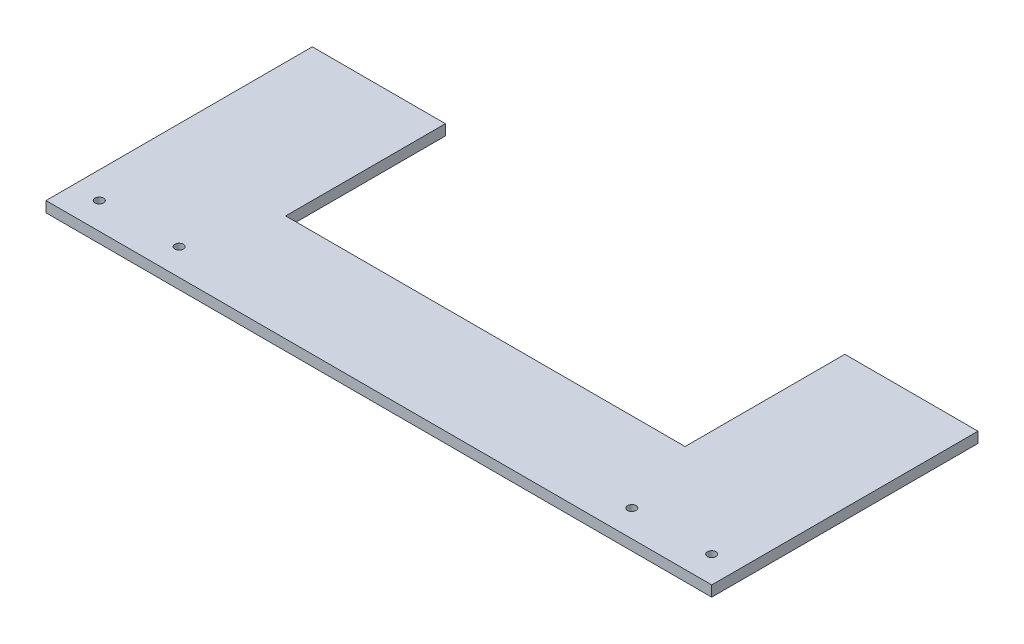
ISO-10303-21;
HEADER;
FILE_DESCRIPTION(('STEP AP214'),'2;1');
FILE_NAME('part.step','',(''),(''),'','','');
FILE_SCHEMA(('AUTOMOTIVE_DESIGN { 1 0 10303 214 1 1 1 1 }'));
ENDSEC;
DATA;
#1=APPLICATION_CONTEXT('core data for automotive mechanical design processes');
#2=APPLICATION_PROTOCOL_DEFINITION('international standard','automotive_design',2000,#1);
#3=PRODUCT_CONTEXT('',#1,'mechanical');
#4=PRODUCT('Part','Part','',(#3));
#5=PRODUCT_RELATED_PRODUCT_CATEGORY('part','',(#4));
#6=PRODUCT_DEFINITION_FORMATION('','',#4);
#7=PRODUCT_DEFINITION_CONTEXT('part definition',#1,'design');
#8=PRODUCT_DEFINITION('design','',#6,#7);
#9=PRODUCT_DEFINITION_SHAPE('','',#8);
#10=(LENGTH_UNIT() NAMED_UNIT(*) SI_UNIT(.MILLI.,.METRE.));
#11=(NAMED_UNIT(*) PLANE_ANGLE_UNIT() SI_UNIT($,.RADIAN.));
#12=(NAMED_UNIT(*) SI_UNIT($,.STERADIAN.) SOLID_ANGLE_UNIT());
#13=UNCERTAINTY_MEASURE_WITH_UNIT(LENGTH_MEASURE(1.E-05),#10,'distance_accuracy_value','');
#14=(GEOMETRIC_REPRESENTATION_CONTEXT(3) GLOBAL_UNCERTAINTY_ASSIGNED_CONTEXT((#13)) GLOBAL_UNIT_ASSIGNED_CONTEXT((#10,
#11,#12)) REPRESENTATION_CONTEXT('',''));
#15=CARTESIAN_POINT('',(0.,0.,0.));
#16=DIRECTION('',(0.,0.,1.));
#17=DIRECTION('',(1.,0.,0.));
#18=AXIS2_PLACEMENT_3D('',#15,#16,#17);
#19=CARTESIAN_POINT('',(125.,4.,-49.9999999999999));
#20=DIRECTION('',(0.,0.,1.));
#21=DIRECTION('',(1.,0.,0.));
#22=AXIS2_PLACEMENT_3D('',#19,#20,#21);
#23=PLANE('',#22);
#24=DIRECTION('',(-1.,0.,0.));
#25=VECTOR('',#24,1.);
#26=CARTESIAN_POINT('',(125.,0.,-49.9999999999999));
#27=LINE('',#26,#25);
#28=CARTESIAN_POINT('',(125.,0.,-49.9999999999999));
#29=VERTEX_POINT('',#28);
#30=CARTESIAN_POINT('',(74.9999940928702,0.,-49.9999999999999));
#31=VERTEX_POINT('',#30);
#32=EDGE_CURVE('E175',#29,#31,#27,.T.);
#33=ORIENTED_EDGE('',*,*,#32,.T.);
#34=DIRECTION('',(0.,1.,0.));
#35=VECTOR('',#34,1.);
#36=CARTESIAN_POINT('',(74.9999940928702,0.,-49.9999999999999));
#37=LINE('',#36,#35);
#38=CARTESIAN_POINT('',(74.9999940928702,4.,-49.9999999999999));
#39=VERTEX_POINT('',#38);
#40=EDGE_CURVE('E143',#31,#39,#37,.T.);
#41=ORIENTED_EDGE('',*,*,#40,.T.);
#42=DIRECTION('',(-1.,0.,0.));
#43=VECTOR('',#42,1.);
#44=CARTESIAN_POINT('',(125.,4.,-49.9999999999999));
#45=LINE('',#44,#43);
#46=CARTESIAN_POINT('',(125.,4.,-49.9999999999999));
#47=VERTEX_POINT('',#46);
#48=EDGE_CURVE('E179',#47,#39,#45,.T.);
#49=ORIENTED_EDGE('',*,*,#48,.F.);
#50=DIRECTION('',(0.,-1.,0.));
#51=VECTOR('',#50,1.);
#52=CARTESIAN_POINT('',(125.,4.,-49.9999999999999));
#53=LINE('',#52,#51);
#54=EDGE_CURVE('E192',#47,#29,#53,.T.);
#55=ORIENTED_EDGE('',*,*,#54,.T.);
#56=EDGE_LOOP('',(#33,#41,#49,#55));
#57=FACE_BOUND('',#56,.T.);
#58=ADVANCED_FACE('F42',(#57),#23,.F.);
#59=CARTESIAN_POINT('',(0.,4.,0.));
#60=DIRECTION('',(0.,1.,0.));
#61=DIRECTION('',(0.,0.,1.));
#62=AXIS2_PLACEMENT_3D('',#59,#60,#61);
#63=PLANE('',#62);
#64=DIRECTION('',(-6.55800816429242E-08,0.,-0.999999999999998));
#65=VECTOR('',#64,1.);
#66=CARTESIAN_POINT('',(74.9999940928702,4.,-49.9999999999999));
#67=LINE('',#66,#65);
#68=CARTESIAN_POINT('',(74.9999980276751,4.,10.));
#69=VERTEX_POINT('',#68);
#70=EDGE_CURVE('E135',#69,#39,#67,.T.);
#71=ORIENTED_EDGE('',*,*,#70,.F.);
#72=DIRECTION('',(1.,0.,0.));
#73=VECTOR('',#72,1.);
#74=CARTESIAN_POINT('',(74.9999980276751,4.,10.));
#75=LINE('',#74,#73);
#76=CARTESIAN_POINT('',(-74.9999980276751,4.,10.));
#77=VERTEX_POINT('',#76);
#78=EDGE_CURVE('E137',#77,#69,#75,.T.);
#79=ORIENTED_EDGE('',*,*,#78,.F.);
#80=DIRECTION('',(-6.55800816429242E-08,0.,0.999999999999998));
#81=VECTOR('',#80,1.);
#82=CARTESIAN_POINT('',(-74.9999940928702,4.,-49.9999999999999));
#83=LINE('',#82,#81);
#84=CARTESIAN_POINT('',(-74.9999940928702,4.,-49.9999999999999));
#85=VERTEX_POINT('',#84);
#86=EDGE_CURVE('E117',#85,#77,#83,.T.);
#87=ORIENTED_EDGE('',*,*,#86,.F.);
#88=CARTESIAN_POINT('',(-125.,4.,-49.9999999999999));
#89=VERTEX_POINT('',#88);
#90=EDGE_CURVE('E66',#85,#89,#45,.T.);
#91=ORIENTED_EDGE('',*,*,#90,.T.);
#92=DIRECTION('',(0.,0.,1.));
#93=VECTOR('',#92,1.);
#94=CARTESIAN_POINT('',(-125.,4.,50.0000000000001));
#95=LINE('',#94,#93);
#96=CARTESIAN_POINT('',(-125.,4.,50.0000000000001));
#97=VERTEX_POINT('',#96);
#98=EDGE_CURVE('E173',#89,#97,#95,.T.);
#99=ORIENTED_EDGE('',*,*,#98,.T.);
#100=DIRECTION('',(1.,0.,0.));
#101=VECTOR('',#100,1.);
#102=CARTESIAN_POINT('',(125.,4.,50.0000000000001));
#103=LINE('',#102,#101);
#104=CARTESIAN_POINT('',(125.,4.,50.0000000000001));
#105=VERTEX_POINT('',#104);
#106=EDGE_CURVE('E94',#97,#105,#103,.T.);
#107=ORIENTED_EDGE('',*,*,#106,.T.);
#108=DIRECTION('',(0.,0.,-1.));
#109=VECTOR('',#108,1.);
#110=CARTESIAN_POINT('',(125.,4.,50.0000000000001));
#111=LINE('',#110,#109);
#112=EDGE_CURVE('E177',#105,#47,#111,.T.);
#113=ORIENTED_EDGE('',*,*,#112,.T.);
#114=ORIENTED_EDGE('',*,*,#48,.T.);
#115=EDGE_LOOP('',(#71,#79,#87,#91,#99,#107,#113,#114));
#116=FACE_BOUND('',#115,.T.);
#117=CARTESIAN_POINT('',(85.,4.,40.0000000000001));
#118=DIRECTION('',(0.,1.,0.));
#119=DIRECTION('',(0.,0.,1.));
#120=AXIS2_PLACEMENT_3D('',#117,#118,#119);
#121=CIRCLE('',#120,1.60000000000001);
#122=CARTESIAN_POINT('',(85.,4.,41.6000000000001));
#123=VERTEX_POINT('',#122);
#124=EDGE_CURVE('E155',#123,#123,#121,.T.);
#125=ORIENTED_EDGE('',*,*,#124,.F.);
#126=EDGE_LOOP('',(#125));
#127=FACE_BOUND('',#126,.T.);
#128=CARTESIAN_POINT('',(-115.,4.,40.0000000000001));
#129=DIRECTION('',(0.,1.,0.));
#130=DIRECTION('',(0.,0.,1.));
#131=AXIS2_PLACEMENT_3D('',#128,#129,#130);
#132=CIRCLE('',#131,1.60000000000001);
#133=CARTESIAN_POINT('',(-115.,4.,41.6000000000001));
#134=VERTEX_POINT('',#133);
#135=EDGE_CURVE('E167',#134,#134,#132,.T.);
#136=ORIENTED_EDGE('',*,*,#135,.F.);
#137=EDGE_LOOP('',(#136));
#138=FACE_BOUND('',#137,.T.);
#139=CARTESIAN_POINT('',(-85.,4.,40.0000000000001));
#140=DIRECTION('',(0.,1.,0.));
#141=DIRECTION('',(0.,0.,-1.));
#142=AXIS2_PLACEMENT_3D('',#139,#140,#141);
#143=CIRCLE('',#142,1.60000000000001);
#144=CARTESIAN_POINT('',(-85.,4.,38.4000000000001));
#145=VERTEX_POINT('',#144);
#146=EDGE_CURVE('E161',#145,#145,#143,.T.);
#147=ORIENTED_EDGE('',*,*,#146,.F.);
#148=EDGE_LOOP('',(#147));
#149=FACE_BOUND('',#148,.T.);
#150=CARTESIAN_POINT('',(115.,4.,40.0000000000001));
#151=DIRECTION('',(0.,1.,0.));
#152=DIRECTION('',(0.,0.,-1.));
#153=AXIS2_PLACEMENT_3D('',#150,#151,#152);
#154=CIRCLE('',#153,1.60000000000001);
#155=CARTESIAN_POINT('',(115.,4.,38.4000000000001));
#156=VERTEX_POINT('',#155);
#157=EDGE_CURVE('E149',#156,#156,#154,.T.);
#158=ORIENTED_EDGE('',*,*,#157,.F.);
#159=EDGE_LOOP('',(#158));
#160=FACE_BOUND('',#159,.T.);
#161=ADVANCED_FACE('F204',(#116,#127,#138,#149,#160),#63,.T.);
#162=CARTESIAN_POINT('',(0.,0.,0.));
#163=DIRECTION('',(0.,1.,0.));
#164=DIRECTION('',(0.,0.,1.));
#165=AXIS2_PLACEMENT_3D('',#162,#163,#164);
#166=PLANE('',#165);
#167=DIRECTION('',(1.,0.,0.));
#168=VECTOR('',#167,1.);
#169=CARTESIAN_POINT('',(74.9999980276751,0.,10.));
#170=LINE('',#169,#168);
#171=CARTESIAN_POINT('',(-74.9999980276751,0.,10.));
#172=VERTEX_POINT('',#171);
#173=CARTESIAN_POINT('',(74.9999980276751,0.,10.));
#174=VERTEX_POINT('',#173);
#175=EDGE_CURVE('E125',#172,#174,#170,.T.);
#176=ORIENTED_EDGE('',*,*,#175,.T.);
#177=DIRECTION('',(-6.55800816429242E-08,0.,-0.999999999999998));
#178=VECTOR('',#177,1.);
#179=CARTESIAN_POINT('',(74.9999940928702,0.,-49.9999999999999));
#180=LINE('',#179,#178);
#181=EDGE_CURVE('E130',#174,#31,#180,.T.);
#182=ORIENTED_EDGE('',*,*,#181,.T.);
#183=ORIENTED_EDGE('',*,*,#32,.F.);
#184=DIRECTION('',(0.,0.,-1.));
#185=VECTOR('',#184,1.);
#186=CARTESIAN_POINT('',(125.,0.,50.0000000000001));
#187=LINE('',#186,#185);
#188=CARTESIAN_POINT('',(125.,0.,50.0000000000001));
#189=VERTEX_POINT('',#188);
#190=EDGE_CURVE('E187',#189,#29,#187,.T.);
#191=ORIENTED_EDGE('',*,*,#190,.F.);
#192=DIRECTION('',(1.,0.,0.));
#193=VECTOR('',#192,1.);
#194=CARTESIAN_POINT('',(125.,0.,50.0000000000001));
#195=LINE('',#194,#193);
#196=CARTESIAN_POINT('',(-125.,0.,50.0000000000001));
#197=VERTEX_POINT('',#196);
#198=EDGE_CURVE('E185',#197,#189,#195,.T.);
#199=ORIENTED_EDGE('',*,*,#198,.F.);
#200=DIRECTION('',(0.,0.,1.));
#201=VECTOR('',#200,1.);
#202=CARTESIAN_POINT('',(-125.,0.,50.0000000000001));
#203=LINE('',#202,#201);
#204=CARTESIAN_POINT('',(-125.,0.,-49.9999999999999));
#205=VERTEX_POINT('',#204);
#206=EDGE_CURVE('E170',#205,#197,#203,.T.);
#207=ORIENTED_EDGE('',*,*,#206,.F.);
#208=CARTESIAN_POINT('',(-74.999998027675,0.,-49.9999999999999));
#209=VERTEX_POINT('',#208);
#210=EDGE_CURVE('E87',#209,#205,#27,.T.);
#211=ORIENTED_EDGE('',*,*,#210,.F.);
#212=DIRECTION('',(-6.55800816429242E-08,0.,0.999999999999998));
#213=VECTOR('',#212,1.);
#214=CARTESIAN_POINT('',(-74.9999940928702,0.,-49.9999999999999));
#215=LINE('',#214,#213);
#216=EDGE_CURVE('E57',#209,#172,#215,.T.);
#217=ORIENTED_EDGE('',*,*,#216,.T.);
#218=EDGE_LOOP('',(#176,#182,#183,#191,#199,#207,#211,#217));
#219=FACE_BOUND('',#218,.T.);
#220=CARTESIAN_POINT('',(-115.,0.,40.0000000000001));
#221=DIRECTION('',(0.,1.,0.));
#222=DIRECTION('',(0.,0.,1.));
#223=AXIS2_PLACEMENT_3D('',#220,#221,#222);
#224=CIRCLE('',#223,1.60000000000001);
#225=CARTESIAN_POINT('',(-115.,0.,41.6000000000001));
#226=VERTEX_POINT('',#225);
#227=EDGE_CURVE('E164',#226,#226,#224,.T.);
#228=ORIENTED_EDGE('',*,*,#227,.T.);
#229=EDGE_LOOP('',(#228));
#230=FACE_BOUND('',#229,.T.);
#231=CARTESIAN_POINT('',(-85.,0.,40.0000000000001));
#232=DIRECTION('',(0.,1.,0.));
#233=DIRECTION('',(0.,0.,-1.));
#234=AXIS2_PLACEMENT_3D('',#231,#232,#233);
#235=CIRCLE('',#234,1.60000000000001);
#236=CARTESIAN_POINT('',(-85.,0.,38.4000000000001));
#237=VERTEX_POINT('',#236);
#238=EDGE_CURVE('E158',#237,#237,#235,.T.);
#239=ORIENTED_EDGE('',*,*,#238,.T.);
#240=EDGE_LOOP('',(#239));
#241=FACE_BOUND('',#240,.T.);
#242=CARTESIAN_POINT('',(85.,0.,40.0000000000001));
#243=DIRECTION('',(0.,1.,0.));
#244=DIRECTION('',(0.,0.,1.));
#245=AXIS2_PLACEMENT_3D('',#242,#243,#244);
#246=CIRCLE('',#245,1.60000000000001);
#247=CARTESIAN_POINT('',(85.,0.,41.6000000000001));
#248=VERTEX_POINT('',#247);
#249=EDGE_CURVE('E152',#248,#248,#246,.T.);
#250=ORIENTED_EDGE('',*,*,#249,.T.);
#251=EDGE_LOOP('',(#250));
#252=FACE_BOUND('',#251,.T.);
#253=CARTESIAN_POINT('',(115.,0.,40.0000000000001));
#254=DIRECTION('',(0.,1.,0.));
#255=DIRECTION('',(0.,0.,-1.));
#256=AXIS2_PLACEMENT_3D('',#253,#254,#255);
#257=CIRCLE('',#256,1.60000000000001);
#258=CARTESIAN_POINT('',(115.,0.,38.4000000000001));
#259=VERTEX_POINT('',#258);
#260=EDGE_CURVE('E146',#259,#259,#257,.T.);
#261=ORIENTED_EDGE('',*,*,#260,.T.);
#262=EDGE_LOOP('',(#261));
#263=FACE_BOUND('',#262,.T.);
#264=ADVANCED_FACE('F132',(#219,#230,#241,#252,#263),#166,.F.);
#265=CARTESIAN_POINT('',(-125.,4.,50.0000000000001));
#266=DIRECTION('',(1.,0.,0.));
#267=DIRECTION('',(0.,0.,-1.));
#268=AXIS2_PLACEMENT_3D('',#265,#266,#267);
#269=PLANE('',#268);
#270=ORIENTED_EDGE('',*,*,#206,.T.);
#271=DIRECTION('',(0.,-1.,0.));
#272=VECTOR('',#271,1.);
#273=CARTESIAN_POINT('',(-125.,4.,50.0000000000001));
#274=LINE('',#273,#272);
#275=EDGE_CURVE('E11',#97,#197,#274,.T.);
#276=ORIENTED_EDGE('',*,*,#275,.F.);
#277=ORIENTED_EDGE('',*,*,#98,.F.);
#278=DIRECTION('',(0.,-1.,0.));
#279=VECTOR('',#278,1.);
#280=CARTESIAN_POINT('',(-125.,4.,-49.9999999999999));
#281=LINE('',#280,#279);
#282=EDGE_CURVE('E182',#89,#205,#281,.T.);
#283=ORIENTED_EDGE('',*,*,#282,.T.);
#284=EDGE_LOOP('',(#270,#276,#277,#283));
#285=FACE_BOUND('',#284,.T.);
#286=ADVANCED_FACE('F44',(#285),#269,.F.);
#287=CARTESIAN_POINT('',(125.,4.,50.0000000000001));
#288=DIRECTION('',(0.,0.,-1.));
#289=DIRECTION('',(-1.,0.,0.));
#290=AXIS2_PLACEMENT_3D('',#287,#288,#289);
#291=PLANE('',#290);
#292=ORIENTED_EDGE('',*,*,#198,.T.);
#293=DIRECTION('',(0.,-1.,0.));
#294=VECTOR('',#293,1.);
#295=CARTESIAN_POINT('',(125.,4.,50.0000000000001));
#296=LINE('',#295,#294);
#297=EDGE_CURVE('E50',#105,#189,#296,.T.);
#298=ORIENTED_EDGE('',*,*,#297,.F.);
#299=ORIENTED_EDGE('',*,*,#106,.F.);
#300=ORIENTED_EDGE('',*,*,#275,.T.);
#301=EDGE_LOOP('',(#292,#298,#299,#300));
#302=FACE_BOUND('',#301,.T.);
#303=ADVANCED_FACE('F209',(#302),#291,.F.);
#304=CARTESIAN_POINT('',(125.,4.,50.0000000000001));
#305=DIRECTION('',(-1.,0.,0.));
#306=DIRECTION('',(0.,0.,1.));
#307=AXIS2_PLACEMENT_3D('',#304,#305,#306);
#308=PLANE('',#307);
#309=ORIENTED_EDGE('',*,*,#190,.T.);
#310=ORIENTED_EDGE('',*,*,#54,.F.);
#311=ORIENTED_EDGE('',*,*,#112,.F.);
#312=ORIENTED_EDGE('',*,*,#297,.T.);
#313=EDGE_LOOP('',(#309,#310,#311,#312));
#314=FACE_BOUND('',#313,.T.);
#315=ADVANCED_FACE('F198',(#314),#308,.F.);
#316=ORIENTED_EDGE('',*,*,#90,.F.);
#317=DIRECTION('',(0.,1.,0.));
#318=VECTOR('',#317,1.);
#319=CARTESIAN_POINT('',(-74.9999940928702,0.,-49.9999999999999));
#320=LINE('',#319,#318);
#321=EDGE_CURVE('E122',#209,#85,#320,.T.);
#322=ORIENTED_EDGE('',*,*,#321,.F.);
#323=ORIENTED_EDGE('',*,*,#210,.T.);
#324=ORIENTED_EDGE('',*,*,#282,.F.);
#325=EDGE_LOOP('',(#316,#322,#323,#324));
#326=FACE_BOUND('',#325,.T.);
#327=ADVANCED_FACE('F215',(#326),#23,.F.);
#328=CARTESIAN_POINT('',(-115.,4.,40.0000000000001));
#329=DIRECTION('',(0.,-1.,0.));
#330=DIRECTION('',(0.,0.,-1.));
#331=AXIS2_PLACEMENT_3D('',#328,#329,#330);
#332=CYLINDRICAL_SURFACE('',#331,1.60000000000001);
#333=ORIENTED_EDGE('',*,*,#135,.T.);
#334=EDGE_LOOP('',(#333));
#335=FACE_BOUND('',#334,.T.);
#336=ORIENTED_EDGE('',*,*,#227,.F.);
#337=EDGE_LOOP('',(#336));
#338=FACE_BOUND('',#337,.T.);
#339=ADVANCED_FACE('F226',(#335,#338),#332,.F.);
#340=CARTESIAN_POINT('',(-85.,4.,40.0000000000001));
#341=DIRECTION('',(0.,-1.,0.));
#342=DIRECTION('',(0.,0.,-1.));
#343=AXIS2_PLACEMENT_3D('',#340,#341,#342);
#344=CYLINDRICAL_SURFACE('',#343,1.60000000000001);
#345=ORIENTED_EDGE('',*,*,#146,.T.);
#346=EDGE_LOOP('',(#345));
#347=FACE_BOUND('',#346,.T.);
#348=ORIENTED_EDGE('',*,*,#238,.F.);
#349=EDGE_LOOP('',(#348));
#350=FACE_BOUND('',#349,.T.);
#351=ADVANCED_FACE('F232',(#347,#350),#344,.F.);
#352=CARTESIAN_POINT('',(85.,4.,40.0000000000001));
#353=DIRECTION('',(0.,-1.,0.));
#354=DIRECTION('',(0.,0.,-1.));
#355=AXIS2_PLACEMENT_3D('',#352,#353,#354);
#356=CYLINDRICAL_SURFACE('',#355,1.60000000000001);
#357=ORIENTED_EDGE('',*,*,#124,.T.);
#358=EDGE_LOOP('',(#357));
#359=FACE_BOUND('',#358,.T.);
#360=ORIENTED_EDGE('',*,*,#249,.F.);
#361=EDGE_LOOP('',(#360));
#362=FACE_BOUND('',#361,.T.);
#363=ADVANCED_FACE('F238',(#359,#362),#356,.F.);
#364=CARTESIAN_POINT('',(115.,4.,40.0000000000001));
#365=DIRECTION('',(0.,-1.,0.));
#366=DIRECTION('',(0.,0.,-1.));
#367=AXIS2_PLACEMENT_3D('',#364,#365,#366);
#368=CYLINDRICAL_SURFACE('',#367,1.60000000000001);
#369=ORIENTED_EDGE('',*,*,#157,.T.);
#370=EDGE_LOOP('',(#369));
#371=FACE_BOUND('',#370,.T.);
#372=ORIENTED_EDGE('',*,*,#260,.F.);
#373=EDGE_LOOP('',(#372));
#374=FACE_BOUND('',#373,.T.);
#375=ADVANCED_FACE('F305',(#371,#374),#368,.F.);
#376=CARTESIAN_POINT('',(74.9999940928702,0.,-49.9999999999999));
#377=DIRECTION('',(0.999999999999998,0.,-6.55800816429242E-08));
#378=DIRECTION('',(-6.55800816429242E-08,0.,-0.999999999999998));
#379=AXIS2_PLACEMENT_3D('',#376,#377,#378);
#380=PLANE('',#379);
#381=ORIENTED_EDGE('',*,*,#70,.T.);
#382=ORIENTED_EDGE('',*,*,#40,.F.);
#383=ORIENTED_EDGE('',*,*,#181,.F.);
#384=DIRECTION('',(0.,1.,0.));
#385=VECTOR('',#384,1.);
#386=CARTESIAN_POINT('',(74.9999980276751,0.,10.));
#387=LINE('',#386,#385);
#388=EDGE_CURVE('E121',#174,#69,#387,.T.);
#389=ORIENTED_EDGE('',*,*,#388,.T.);
#390=EDGE_LOOP('',(#381,#382,#383,#389));
#391=FACE_BOUND('',#390,.T.);
#392=ADVANCED_FACE('F314',(#391),#380,.F.);
#393=CARTESIAN_POINT('',(74.9999980276751,0.,10.));
#394=DIRECTION('',(0.,0.,1.));
#395=DIRECTION('',(1.,0.,0.));
#396=AXIS2_PLACEMENT_3D('',#393,#394,#395);
#397=PLANE('',#396);
#398=ORIENTED_EDGE('',*,*,#78,.T.);
#399=ORIENTED_EDGE('',*,*,#388,.F.);
#400=ORIENTED_EDGE('',*,*,#175,.F.);
#401=DIRECTION('',(0.,1.,0.));
#402=VECTOR('',#401,1.);
#403=CARTESIAN_POINT('',(-74.9999980276751,0.,10.));
#404=LINE('',#403,#402);
#405=EDGE_CURVE('E114',#172,#77,#404,.T.);
#406=ORIENTED_EDGE('',*,*,#405,.T.);
#407=EDGE_LOOP('',(#398,#399,#400,#406));
#408=FACE_BOUND('',#407,.T.);
#409=ADVANCED_FACE('F126',(#408),#397,.F.);
#410=CARTESIAN_POINT('',(-74.9999940928702,0.,-49.9999999999999));
#411=DIRECTION('',(-0.999999999999998,0.,-6.55800816429242E-08));
#412=DIRECTION('',(-6.55800816429242E-08,0.,0.999999999999998));
#413=AXIS2_PLACEMENT_3D('',#410,#411,#412);
#414=PLANE('',#413);
#415=ORIENTED_EDGE('',*,*,#86,.T.);
#416=ORIENTED_EDGE('',*,*,#405,.F.);
#417=ORIENTED_EDGE('',*,*,#216,.F.);
#418=ORIENTED_EDGE('',*,*,#321,.T.);
#419=EDGE_LOOP('',(#415,#416,#417,#418));
#420=FACE_BOUND('',#419,.T.);
#421=ADVANCED_FACE('F116',(#420),#414,.F.);
#422=CLOSED_SHELL('',(#58,#161,#264,#286,#303,#315,#327,#339,#351,#363,#375,#392,#409,#421));
#423=MANIFOLD_SOLID_BREP('B2',#422);
#424=ADVANCED_BREP_SHAPE_REPRESENTATION('',(#18,#423),#14);
#425=SHAPE_DEFINITION_REPRESENTATION(#9,#424);
ENDSEC;
END-ISO-10303-21;
